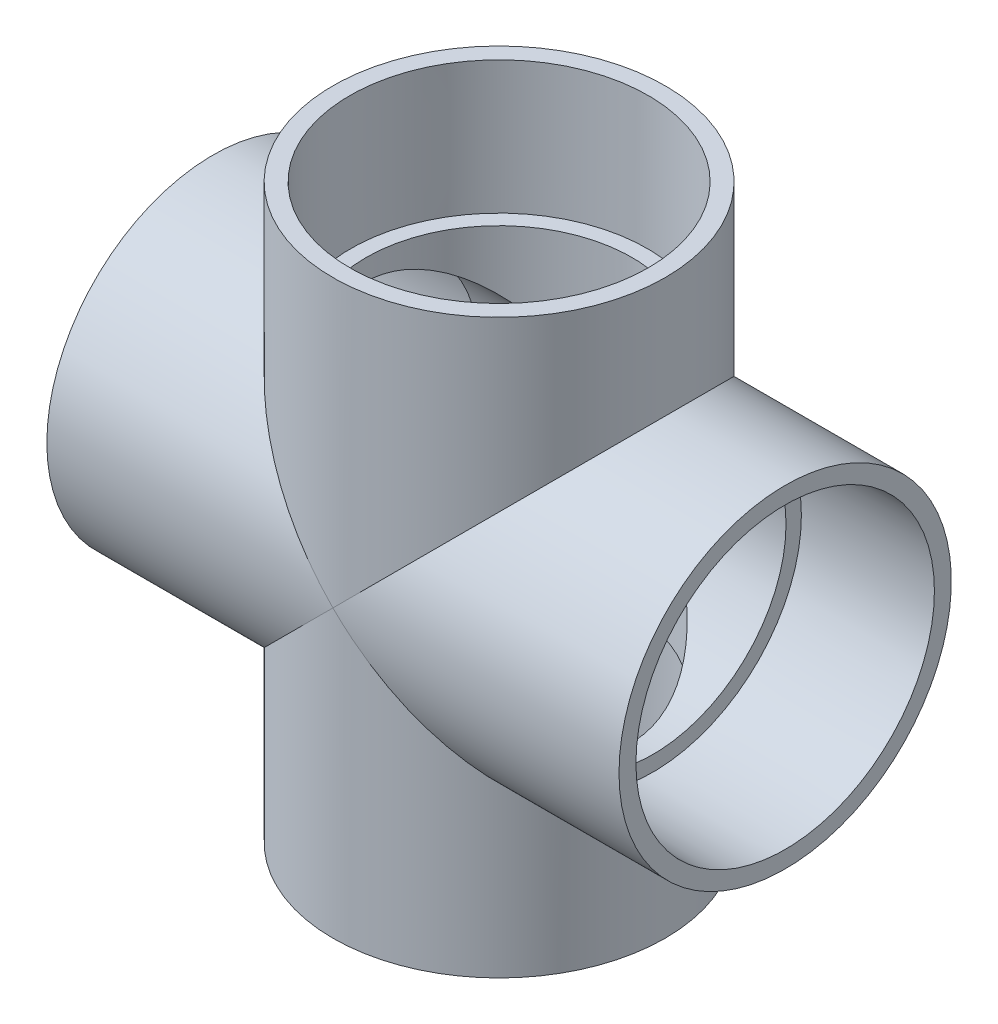
ISO-10303-21;
HEADER;
FILE_DESCRIPTION(('STEP AP214'),'2;1');
FILE_NAME('part.step','',(''),(''),'','','');
FILE_SCHEMA(('AUTOMOTIVE_DESIGN { 1 0 10303 214 1 1 1 1 }'));
ENDSEC;
DATA;
#1=APPLICATION_CONTEXT('core data for automotive mechanical design processes');
#2=APPLICATION_PROTOCOL_DEFINITION('international standard','automotive_design',2000,#1);
#3=PRODUCT_CONTEXT('',#1,'mechanical');
#4=PRODUCT('Part','Part','',(#3));
#5=PRODUCT_RELATED_PRODUCT_CATEGORY('part','',(#4));
#6=PRODUCT_DEFINITION_FORMATION('','',#4);
#7=PRODUCT_DEFINITION_CONTEXT('part definition',#1,'design');
#8=PRODUCT_DEFINITION('design','',#6,#7);
#9=PRODUCT_DEFINITION_SHAPE('','',#8);
#10=(LENGTH_UNIT() NAMED_UNIT(*) SI_UNIT(.MILLI.,.METRE.));
#11=(NAMED_UNIT(*) PLANE_ANGLE_UNIT() SI_UNIT($,.RADIAN.));
#12=(NAMED_UNIT(*) SI_UNIT($,.STERADIAN.) SOLID_ANGLE_UNIT());
#13=UNCERTAINTY_MEASURE_WITH_UNIT(LENGTH_MEASURE(1.E-05),#10,'distance_accuracy_value','');
#14=(GEOMETRIC_REPRESENTATION_CONTEXT(3) GLOBAL_UNCERTAINTY_ASSIGNED_CONTEXT((#13)) GLOBAL_UNIT_ASSIGNED_CONTEXT((#10,
#11,#12)) REPRESENTATION_CONTEXT('',''));
#15=CARTESIAN_POINT('',(0.,0.,0.));
#16=DIRECTION('',(0.,0.,1.));
#17=DIRECTION('',(1.,0.,0.));
#18=AXIS2_PLACEMENT_3D('',#15,#16,#17);
#19=CARTESIAN_POINT('',(0.,59.1819999999998,0.));
#20=DIRECTION('',(0.,-1.,0.));
#21=DIRECTION('',(1.,0.,0.));
#22=AXIS2_PLACEMENT_3D('',#19,#20,#21);
#23=PLANE('',#22);
#24=CARTESIAN_POINT('',(0.,59.1819999999998,0.));
#25=DIRECTION('',(0.,-1.,0.));
#26=DIRECTION('',(1.,0.,0.));
#27=AXIS2_PLACEMENT_3D('',#24,#25,#26);
#28=CIRCLE('',#27,57.0357);
#29=CARTESIAN_POINT('',(57.0357,59.1819999999998,0.));
#30=VERTEX_POINT('',#29);
#31=EDGE_CURVE('E92',#30,#30,#28,.T.);
#32=ORIENTED_EDGE('',*,*,#31,.F.);
#33=EDGE_LOOP('',(#32));
#34=FACE_BOUND('',#33,.T.);
#35=CARTESIAN_POINT('',(0.,59.1819999999998,0.));
#36=DIRECTION('',(0.,1.,0.));
#37=DIRECTION('',(-1.,0.,0.));
#38=AXIS2_PLACEMENT_3D('',#35,#36,#37);
#39=CIRCLE('',#38,51.1302);
#40=CARTESIAN_POINT('',(-51.1302,59.1819999999998,0.));
#41=VERTEX_POINT('',#40);
#42=EDGE_CURVE('E136',#41,#41,#39,.T.);
#43=ORIENTED_EDGE('',*,*,#42,.F.);
#44=EDGE_LOOP('',(#43));
#45=FACE_BOUND('',#44,.T.);
#46=ADVANCED_FACE('F44',(#34,#45),#23,.F.);
#47=CARTESIAN_POINT('',(0.,-59.1819999999998,0.));
#48=DIRECTION('',(0.,-1.,0.));
#49=DIRECTION('',(1.,0.,0.));
#50=AXIS2_PLACEMENT_3D('',#47,#48,#49);
#51=PLANE('',#50);
#52=CARTESIAN_POINT('',(0.,-59.1819999999998,0.));
#53=DIRECTION('',(0.,1.,0.));
#54=DIRECTION('',(-1.,0.,0.));
#55=AXIS2_PLACEMENT_3D('',#52,#53,#54);
#56=CIRCLE('',#55,51.1302);
#57=CARTESIAN_POINT('',(-51.1302,-59.1819999999999,0.));
#58=VERTEX_POINT('',#57);
#59=EDGE_CURVE('E139',#58,#58,#56,.T.);
#60=ORIENTED_EDGE('',*,*,#59,.T.);
#61=EDGE_LOOP('',(#60));
#62=FACE_BOUND('',#61,.T.);
#63=CARTESIAN_POINT('',(0.,-59.1819999999998,0.));
#64=DIRECTION('',(0.,-1.,0.));
#65=DIRECTION('',(1.,0.,0.));
#66=AXIS2_PLACEMENT_3D('',#63,#64,#65);
#67=CIRCLE('',#66,57.0357);
#68=CARTESIAN_POINT('',(57.0357,-59.1819999999998,0.));
#69=VERTEX_POINT('',#68);
#70=EDGE_CURVE('E127',#69,#69,#67,.T.);
#71=ORIENTED_EDGE('',*,*,#70,.T.);
#72=EDGE_LOOP('',(#71));
#73=FACE_BOUND('',#72,.T.);
#74=ADVANCED_FACE('F143',(#62,#73),#51,.T.);
#75=CARTESIAN_POINT('',(109.982,0.,0.));
#76=DIRECTION('',(1.,0.,0.));
#77=DIRECTION('',(0.,0.,-1.));
#78=AXIS2_PLACEMENT_3D('',#75,#76,#77);
#79=CYLINDRICAL_SURFACE('',#78,51.1302);
#80=CARTESIAN_POINT('',(59.1819999999998,0.,0.));
#81=DIRECTION('',(1.,0.,0.));
#82=DIRECTION('',(0.,0.,-1.));
#83=AXIS2_PLACEMENT_3D('',#80,#81,#82);
#84=CIRCLE('',#83,51.1302);
#85=CARTESIAN_POINT('',(59.1819999999998,0.,-51.1302));
#86=VERTEX_POINT('',#85);
#87=EDGE_CURVE('E133',#86,#86,#84,.T.);
#88=ORIENTED_EDGE('',*,*,#87,.T.);
#89=EDGE_LOOP('',(#88));
#90=FACE_BOUND('',#89,.T.);
#91=CARTESIAN_POINT('',(0.,0.,0.));
#92=DIRECTION('',(0.707106781186548,-0.707106781186547,0.));
#93=DIRECTION('',(0.707106781186547,0.707106781186548,0.));
#94=AXIS2_PLACEMENT_3D('',#91,#92,#93);
#95=ELLIPSE('',#94,72.3090222868488,51.1302);
#96=CARTESIAN_POINT('',(0.,0.,51.1302));
#97=VERTEX_POINT('',#96);
#98=CARTESIAN_POINT('',(0.,0.,-51.1302));
#99=VERTEX_POINT('',#98);
#100=EDGE_CURVE('E57',#97,#99,#95,.F.);
#101=ORIENTED_EDGE('',*,*,#100,.T.);
#102=CARTESIAN_POINT('',(0.,0.,0.));
#103=DIRECTION('',(0.707106781186547,0.707106781186548,0.));
#104=DIRECTION('',(0.707106781186548,-0.707106781186547,0.));
#105=AXIS2_PLACEMENT_3D('',#102,#103,#104);
#106=ELLIPSE('',#105,72.3090222868488,51.1302);
#107=EDGE_CURVE('E13',#99,#97,#106,.F.);
#108=ORIENTED_EDGE('',*,*,#107,.T.);
#109=EDGE_LOOP('',(#101,#108));
#110=FACE_BOUND('',#109,.T.);
#111=ADVANCED_FACE('F84',(#90,#110),#79,.F.);
#112=CARTESIAN_POINT('',(-59.1819999999998,0.,0.));
#113=DIRECTION('',(1.,0.,0.));
#114=DIRECTION('',(0.,0.,-1.));
#115=AXIS2_PLACEMENT_3D('',#112,#113,#114);
#116=CIRCLE('',#115,51.1302);
#117=CARTESIAN_POINT('',(-59.1819999999998,0.,-51.1302));
#118=VERTEX_POINT('',#117);
#119=EDGE_CURVE('E130',#118,#118,#116,.T.);
#120=ORIENTED_EDGE('',*,*,#119,.F.);
#121=EDGE_LOOP('',(#120));
#122=FACE_BOUND('',#121,.T.);
#123=CARTESIAN_POINT('',(0.,0.,0.));
#124=DIRECTION('',(0.707106781186548,-0.707106781186547,0.));
#125=DIRECTION('',(0.707106781186547,0.707106781186548,0.));
#126=AXIS2_PLACEMENT_3D('',#123,#124,#125);
#127=ELLIPSE('',#126,72.3090222868488,51.1302);
#128=EDGE_CURVE('E74',#97,#99,#127,.T.);
#129=ORIENTED_EDGE('',*,*,#128,.T.);
#130=CARTESIAN_POINT('',(0.,0.,0.));
#131=DIRECTION('',(0.707106781186547,0.707106781186548,0.));
#132=DIRECTION('',(0.707106781186548,-0.707106781186547,0.));
#133=AXIS2_PLACEMENT_3D('',#130,#131,#132);
#134=ELLIPSE('',#133,72.3090222868488,51.1302);
#135=EDGE_CURVE('E52',#99,#97,#134,.T.);
#136=ORIENTED_EDGE('',*,*,#135,.T.);
#137=EDGE_LOOP('',(#129,#136));
#138=FACE_BOUND('',#137,.T.);
#139=ADVANCED_FACE('F85',(#122,#138),#79,.F.);
#140=CARTESIAN_POINT('',(-59.1819999999998,0.,0.));
#141=DIRECTION('',(1.,0.,0.));
#142=DIRECTION('',(0.,0.,-1.));
#143=AXIS2_PLACEMENT_3D('',#140,#141,#142);
#144=PLANE('',#143);
#145=ORIENTED_EDGE('',*,*,#119,.T.);
#146=EDGE_LOOP('',(#145));
#147=FACE_BOUND('',#146,.T.);
#148=CARTESIAN_POINT('',(-59.1819999999998,0.,0.));
#149=DIRECTION('',(-1.,0.,0.));
#150=DIRECTION('',(0.,0.,1.));
#151=AXIS2_PLACEMENT_3D('',#148,#149,#150);
#152=CIRCLE('',#151,57.0357);
#153=CARTESIAN_POINT('',(-59.1819999999998,0.,57.0357));
#154=VERTEX_POINT('',#153);
#155=EDGE_CURVE('E104',#154,#154,#152,.T.);
#156=ORIENTED_EDGE('',*,*,#155,.T.);
#157=EDGE_LOOP('',(#156));
#158=FACE_BOUND('',#157,.T.);
#159=ADVANCED_FACE('F191',(#147,#158),#144,.F.);
#160=CARTESIAN_POINT('',(59.1819999999998,0.,0.));
#161=DIRECTION('',(1.,0.,0.));
#162=DIRECTION('',(0.,0.,-1.));
#163=AXIS2_PLACEMENT_3D('',#160,#161,#162);
#164=PLANE('',#163);
#165=CARTESIAN_POINT('',(59.1819999999998,0.,0.));
#166=DIRECTION('',(1.,0.,0.));
#167=DIRECTION('',(0.,0.,-1.));
#168=AXIS2_PLACEMENT_3D('',#165,#166,#167);
#169=CIRCLE('',#168,57.0357);
#170=CARTESIAN_POINT('',(59.1819999999998,0.,-57.0357));
#171=VERTEX_POINT('',#170);
#172=EDGE_CURVE('E82',#171,#171,#169,.F.);
#173=ORIENTED_EDGE('',*,*,#172,.F.);
#174=EDGE_LOOP('',(#173));
#175=FACE_BOUND('',#174,.T.);
#176=ORIENTED_EDGE('',*,*,#87,.F.);
#177=EDGE_LOOP('',(#176));
#178=FACE_BOUND('',#177,.T.);
#179=ADVANCED_FACE('F187',(#175,#178),#164,.T.);
#180=CARTESIAN_POINT('',(59.1819999999998,0.,0.));
#181=DIRECTION('',(-1.,0.,0.));
#182=DIRECTION('',(0.,0.,1.));
#183=AXIS2_PLACEMENT_3D('',#180,#181,#182);
#184=CYLINDRICAL_SURFACE('',#183,63.881);
#185=CARTESIAN_POINT('',(109.982,0.,0.));
#186=DIRECTION('',(-1.,0.,0.));
#187=DIRECTION('',(0.,0.,1.));
#188=AXIS2_PLACEMENT_3D('',#185,#186,#187);
#189=CIRCLE('',#188,63.881);
#190=CARTESIAN_POINT('',(109.982,0.,63.881));
#191=VERTEX_POINT('',#190);
#192=EDGE_CURVE('E115',#191,#191,#189,.T.);
#193=ORIENTED_EDGE('',*,*,#192,.T.);
#194=EDGE_LOOP('',(#193));
#195=FACE_BOUND('',#194,.T.);
#196=CARTESIAN_POINT('',(0.,0.,0.));
#197=DIRECTION('',(-0.707106781186547,-0.707106781186548,0.));
#198=DIRECTION('',(-0.707106781186547,0.707106781186548,0.));
#199=AXIS2_PLACEMENT_3D('',#196,#197,#198);
#200=ELLIPSE('',#199,90.3413765779557,63.881);
#201=CARTESIAN_POINT('',(0.,0.,-63.8810000000001));
#202=VERTEX_POINT('',#201);
#203=CARTESIAN_POINT('',(0.,0.,63.8810000000001));
#204=VERTEX_POINT('',#203);
#205=EDGE_CURVE('E119',#202,#204,#200,.T.);
#206=ORIENTED_EDGE('',*,*,#205,.F.);
#207=CARTESIAN_POINT('',(0.,0.,0.));
#208=DIRECTION('',(0.707106781186547,-0.707106781186547,0.));
#209=DIRECTION('',(-0.707106781186547,-0.707106781186547,0.));
#210=AXIS2_PLACEMENT_3D('',#207,#208,#209);
#211=ELLIPSE('',#210,90.3413765779557,63.881);
#212=EDGE_CURVE('E110',#202,#204,#211,.T.);
#213=ORIENTED_EDGE('',*,*,#212,.T.);
#214=EDGE_LOOP('',(#206,#213));
#215=FACE_BOUND('',#214,.T.);
#216=ADVANCED_FACE('F190',(#195,#215),#184,.T.);
#217=CARTESIAN_POINT('',(-109.982,0.,0.));
#218=DIRECTION('',(-1.,0.,0.));
#219=DIRECTION('',(0.,0.,1.));
#220=AXIS2_PLACEMENT_3D('',#217,#218,#219);
#221=CIRCLE('',#220,63.881);
#222=CARTESIAN_POINT('',(-109.982,0.,63.881));
#223=VERTEX_POINT('',#222);
#224=EDGE_CURVE('E107',#223,#223,#221,.T.);
#225=ORIENTED_EDGE('',*,*,#224,.F.);
#226=EDGE_LOOP('',(#225));
#227=FACE_BOUND('',#226,.T.);
#228=CARTESIAN_POINT('',(0.,0.,0.));
#229=DIRECTION('',(-0.707106781186547,-0.707106781186547,0.));
#230=DIRECTION('',(0.707106781186547,-0.707106781186547,0.));
#231=AXIS2_PLACEMENT_3D('',#228,#229,#230);
#232=ELLIPSE('',#231,90.3413765779557,63.881);
#233=EDGE_CURVE('E98',#204,#202,#232,.T.);
#234=ORIENTED_EDGE('',*,*,#233,.T.);
#235=CARTESIAN_POINT('',(0.,0.,0.));
#236=DIRECTION('',(-0.707106781186547,0.707106781186548,0.));
#237=DIRECTION('',(-0.707106781186547,-0.707106781186548,0.));
#238=AXIS2_PLACEMENT_3D('',#235,#236,#237);
#239=ELLIPSE('',#238,90.3413765779557,63.881);
#240=EDGE_CURVE('E64',#204,#202,#239,.F.);
#241=ORIENTED_EDGE('',*,*,#240,.F.);
#242=EDGE_LOOP('',(#234,#241));
#243=FACE_BOUND('',#242,.T.);
#244=ADVANCED_FACE('F181',(#227,#243),#184,.T.);
#245=CARTESIAN_POINT('',(-59.1819999999998,0.,0.));
#246=DIRECTION('',(-1.,0.,0.));
#247=DIRECTION('',(0.,0.,1.));
#248=AXIS2_PLACEMENT_3D('',#245,#246,#247);
#249=CONICAL_SURFACE('',#248,57.0357,0.00674989748717743);
#250=CARTESIAN_POINT('',(-109.982,0.,0.));
#251=DIRECTION('',(-1.,0.,0.));
#252=DIRECTION('',(0.,0.,1.));
#253=AXIS2_PLACEMENT_3D('',#250,#251,#252);
#254=CIRCLE('',#253,57.3786);
#255=CARTESIAN_POINT('',(-109.982,0.,57.3786));
#256=VERTEX_POINT('',#255);
#257=EDGE_CURVE('E101',#256,#256,#254,.T.);
#258=ORIENTED_EDGE('',*,*,#257,.T.);
#259=EDGE_LOOP('',(#258));
#260=FACE_BOUND('',#259,.T.);
#261=ORIENTED_EDGE('',*,*,#155,.F.);
#262=EDGE_LOOP('',(#261));
#263=FACE_BOUND('',#262,.T.);
#264=ADVANCED_FACE('F173',(#260,#263),#249,.F.);
#265=CARTESIAN_POINT('',(109.982,0.,0.));
#266=DIRECTION('',(1.,0.,0.));
#267=DIRECTION('',(0.,0.,-1.));
#268=AXIS2_PLACEMENT_3D('',#265,#266,#267);
#269=CONICAL_SURFACE('',#268,57.3786,0.00674989748717716);
#270=CARTESIAN_POINT('',(109.982,0.,0.));
#271=DIRECTION('',(-1.,0.,0.));
#272=DIRECTION('',(0.,0.,1.));
#273=AXIS2_PLACEMENT_3D('',#270,#271,#272);
#274=CIRCLE('',#273,57.3786);
#275=CARTESIAN_POINT('',(109.982,0.,57.3786));
#276=VERTEX_POINT('',#275);
#277=EDGE_CURVE('E112',#276,#276,#274,.T.);
#278=ORIENTED_EDGE('',*,*,#277,.F.);
#279=EDGE_LOOP('',(#278));
#280=FACE_BOUND('',#279,.T.);
#281=ORIENTED_EDGE('',*,*,#172,.T.);
#282=EDGE_LOOP('',(#281));
#283=FACE_BOUND('',#282,.T.);
#284=ADVANCED_FACE('F169',(#280,#283),#269,.F.);
#285=CARTESIAN_POINT('',(0.,109.982,0.));
#286=DIRECTION('',(0.,1.,0.));
#287=DIRECTION('',(-1.,0.,0.));
#288=AXIS2_PLACEMENT_3D('',#285,#286,#287);
#289=CONICAL_SURFACE('',#288,57.3786,0.00674989748717743);
#290=CARTESIAN_POINT('',(0.,109.982,0.));
#291=DIRECTION('',(0.,-1.,0.));
#292=DIRECTION('',(1.,0.,0.));
#293=AXIS2_PLACEMENT_3D('',#290,#291,#292);
#294=CIRCLE('',#293,57.3786);
#295=CARTESIAN_POINT('',(57.3786,109.982,0.));
#296=VERTEX_POINT('',#295);
#297=EDGE_CURVE('E95',#296,#296,#294,.T.);
#298=ORIENTED_EDGE('',*,*,#297,.F.);
#299=EDGE_LOOP('',(#298));
#300=FACE_BOUND('',#299,.T.);
#301=ORIENTED_EDGE('',*,*,#31,.T.);
#302=EDGE_LOOP('',(#301));
#303=FACE_BOUND('',#302,.T.);
#304=ADVANCED_FACE('F172',(#300,#303),#289,.F.);
#305=CARTESIAN_POINT('',(63.8809999999999,109.982,0.));
#306=DIRECTION('',(0.,1.,0.));
#307=DIRECTION('',(-1.,0.,0.));
#308=AXIS2_PLACEMENT_3D('',#305,#306,#307);
#309=PLANE('',#308);
#310=ORIENTED_EDGE('',*,*,#297,.T.);
#311=EDGE_LOOP('',(#310));
#312=FACE_BOUND('',#311,.T.);
#313=CARTESIAN_POINT('',(0.,109.982,0.));
#314=DIRECTION('',(0.,-1.,0.));
#315=DIRECTION('',(1.,0.,0.));
#316=AXIS2_PLACEMENT_3D('',#313,#314,#315);
#317=CIRCLE('',#316,63.881);
#318=CARTESIAN_POINT('',(63.881,109.982,0.));
#319=VERTEX_POINT('',#318);
#320=EDGE_CURVE('E89',#319,#319,#317,.T.);
#321=ORIENTED_EDGE('',*,*,#320,.F.);
#322=EDGE_LOOP('',(#321));
#323=FACE_BOUND('',#322,.T.);
#324=ADVANCED_FACE('F46',(#312,#323),#309,.T.);
#325=CARTESIAN_POINT('',(0.,0.,0.));
#326=DIRECTION('',(0.,-1.,0.));
#327=DIRECTION('',(1.,0.,0.));
#328=AXIS2_PLACEMENT_3D('',#325,#326,#327);
#329=CYLINDRICAL_SURFACE('',#328,63.881);
#330=ORIENTED_EDGE('',*,*,#212,.F.);
#331=ORIENTED_EDGE('',*,*,#233,.F.);
#332=EDGE_LOOP('',(#330,#331));
#333=FACE_BOUND('',#332,.T.);
#334=ORIENTED_EDGE('',*,*,#320,.T.);
#335=EDGE_LOOP('',(#334));
#336=FACE_BOUND('',#335,.T.);
#337=ADVANCED_FACE('F185',(#333,#336),#329,.T.);
#338=CARTESIAN_POINT('',(-109.982,-63.8809999999999,0.));
#339=DIRECTION('',(-1.,0.,0.));
#340=DIRECTION('',(0.,0.,1.));
#341=AXIS2_PLACEMENT_3D('',#338,#339,#340);
#342=PLANE('',#341);
#343=ORIENTED_EDGE('',*,*,#224,.T.);
#344=EDGE_LOOP('',(#343));
#345=FACE_BOUND('',#344,.T.);
#346=ORIENTED_EDGE('',*,*,#257,.F.);
#347=EDGE_LOOP('',(#346));
#348=FACE_BOUND('',#347,.T.);
#349=ADVANCED_FACE('F177',(#345,#348),#342,.T.);
#350=CARTESIAN_POINT('',(109.982,-63.8809999999999,0.));
#351=DIRECTION('',(1.,0.,0.));
#352=DIRECTION('',(0.,0.,-1.));
#353=AXIS2_PLACEMENT_3D('',#350,#351,#352);
#354=PLANE('',#353);
#355=ORIENTED_EDGE('',*,*,#277,.T.);
#356=EDGE_LOOP('',(#355));
#357=FACE_BOUND('',#356,.T.);
#358=ORIENTED_EDGE('',*,*,#192,.F.);
#359=EDGE_LOOP('',(#358));
#360=FACE_BOUND('',#359,.T.);
#361=ADVANCED_FACE('F168',(#357,#360),#354,.T.);
#362=CARTESIAN_POINT('',(0.,-59.1819999999998,0.));
#363=DIRECTION('',(0.,1.,0.));
#364=DIRECTION('',(-1.,0.,0.));
#365=AXIS2_PLACEMENT_3D('',#362,#363,#364);
#366=CYLINDRICAL_SURFACE('',#365,63.881);
#367=ORIENTED_EDGE('',*,*,#205,.T.);
#368=ORIENTED_EDGE('',*,*,#240,.T.);
#369=EDGE_LOOP('',(#367,#368));
#370=FACE_BOUND('',#369,.T.);
#371=CARTESIAN_POINT('',(0.,-109.982,0.));
#372=DIRECTION('',(0.,-1.,0.));
#373=DIRECTION('',(1.,0.,0.));
#374=AXIS2_PLACEMENT_3D('',#371,#372,#373);
#375=CIRCLE('',#374,63.881);
#376=CARTESIAN_POINT('',(63.881,-109.982,0.));
#377=VERTEX_POINT('',#376);
#378=EDGE_CURVE('E121',#377,#377,#375,.T.);
#379=ORIENTED_EDGE('',*,*,#378,.F.);
#380=EDGE_LOOP('',(#379));
#381=FACE_BOUND('',#380,.T.);
#382=ADVANCED_FACE('F164',(#370,#381),#366,.T.);
#383=CARTESIAN_POINT('',(0.,-59.1819999999998,0.));
#384=DIRECTION('',(0.,-1.,0.));
#385=DIRECTION('',(1.,0.,0.));
#386=AXIS2_PLACEMENT_3D('',#383,#384,#385);
#387=CONICAL_SURFACE('',#386,57.0357,0.00674989748717743);
#388=CARTESIAN_POINT('',(0.,-109.982,0.));
#389=DIRECTION('',(0.,-1.,0.));
#390=DIRECTION('',(1.,0.,0.));
#391=AXIS2_PLACEMENT_3D('',#388,#389,#390);
#392=CIRCLE('',#391,57.3786);
#393=CARTESIAN_POINT('',(57.3786,-109.982,0.));
#394=VERTEX_POINT('',#393);
#395=EDGE_CURVE('E124',#394,#394,#392,.T.);
#396=ORIENTED_EDGE('',*,*,#395,.T.);
#397=EDGE_LOOP('',(#396));
#398=FACE_BOUND('',#397,.T.);
#399=ORIENTED_EDGE('',*,*,#70,.F.);
#400=EDGE_LOOP('',(#399));
#401=FACE_BOUND('',#400,.T.);
#402=ADVANCED_FACE('F167',(#398,#401),#387,.F.);
#403=CARTESIAN_POINT('',(63.8809999999999,-109.982,0.));
#404=DIRECTION('',(0.,-1.,0.));
#405=DIRECTION('',(1.,0.,0.));
#406=AXIS2_PLACEMENT_3D('',#403,#404,#405);
#407=PLANE('',#406);
#408=ORIENTED_EDGE('',*,*,#378,.T.);
#409=EDGE_LOOP('',(#408));
#410=FACE_BOUND('',#409,.T.);
#411=ORIENTED_EDGE('',*,*,#395,.F.);
#412=EDGE_LOOP('',(#411));
#413=FACE_BOUND('',#412,.T.);
#414=ADVANCED_FACE('F150',(#410,#413),#407,.T.);
#415=CARTESIAN_POINT('',(0.,109.982,0.));
#416=DIRECTION('',(0.,1.,0.));
#417=DIRECTION('',(-1.,0.,0.));
#418=AXIS2_PLACEMENT_3D('',#415,#416,#417);
#419=CYLINDRICAL_SURFACE('',#418,51.1302);
#420=ORIENTED_EDGE('',*,*,#42,.T.);
#421=EDGE_LOOP('',(#420));
#422=FACE_BOUND('',#421,.T.);
#423=ORIENTED_EDGE('',*,*,#100,.F.);
#424=ORIENTED_EDGE('',*,*,#135,.F.);
#425=EDGE_LOOP('',(#423,#424));
#426=FACE_BOUND('',#425,.T.);
#427=ADVANCED_FACE('F81',(#422,#426),#419,.F.);
#428=ORIENTED_EDGE('',*,*,#128,.F.);
#429=ORIENTED_EDGE('',*,*,#107,.F.);
#430=EDGE_LOOP('',(#428,#429));
#431=FACE_BOUND('',#430,.T.);
#432=ORIENTED_EDGE('',*,*,#59,.F.);
#433=EDGE_LOOP('',(#432));
#434=FACE_BOUND('',#433,.T.);
#435=ADVANCED_FACE('F75',(#431,#434),#419,.F.);
#436=CLOSED_SHELL('',(#46,#74,#111,#139,#159,#179,#216,#244,#264,#284,#304,#324,#337,#349,#361,
#382,#402,#414,#427,#435));
#437=MANIFOLD_SOLID_BREP('B2',#436);
#438=ADVANCED_BREP_SHAPE_REPRESENTATION('',(#18,#437),#14);
#439=SHAPE_DEFINITION_REPRESENTATION(#9,#438);
ENDSEC;
END-ISO-10303-21;
